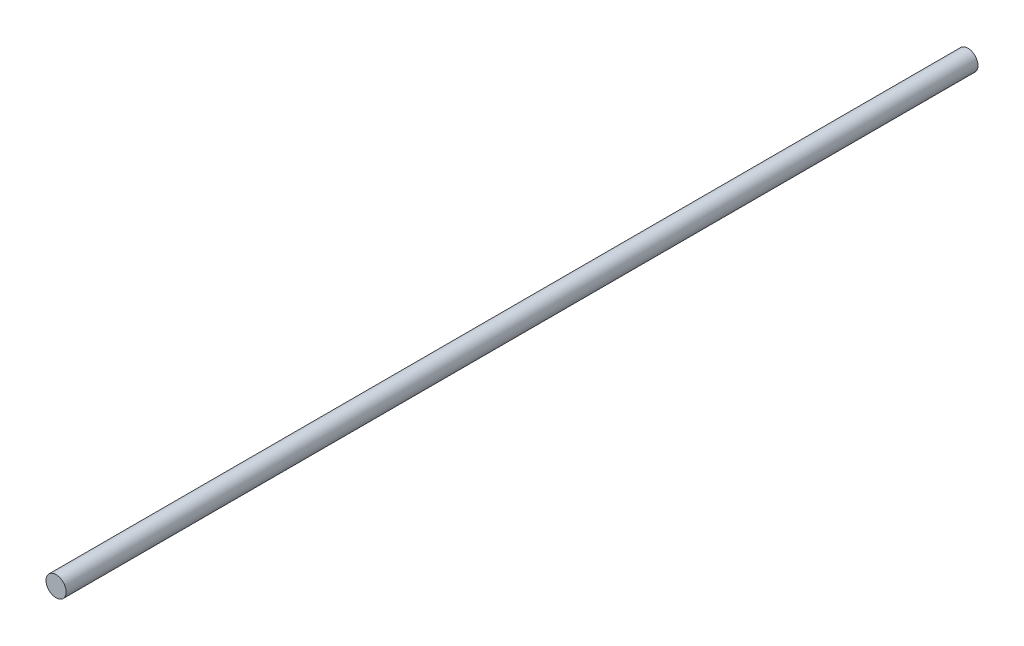
ISO-10303-21;
HEADER;
FILE_DESCRIPTION(('STEP AP214'),'2;1');
FILE_NAME('part.step','',(''),(''),'','','');
FILE_SCHEMA(('AUTOMOTIVE_DESIGN { 1 0 10303 214 1 1 1 1 }'));
ENDSEC;
DATA;
#1=APPLICATION_CONTEXT('core data for automotive mechanical design processes');
#2=APPLICATION_PROTOCOL_DEFINITION('international standard','automotive_design',2000,#1);
#3=PRODUCT_CONTEXT('',#1,'mechanical');
#4=PRODUCT('Part','Part','',(#3));
#5=PRODUCT_RELATED_PRODUCT_CATEGORY('part','',(#4));
#6=PRODUCT_DEFINITION_FORMATION('','',#4);
#7=PRODUCT_DEFINITION_CONTEXT('part definition',#1,'design');
#8=PRODUCT_DEFINITION('design','',#6,#7);
#9=PRODUCT_DEFINITION_SHAPE('','',#8);
#10=(LENGTH_UNIT() NAMED_UNIT(*) SI_UNIT(.MILLI.,.METRE.));
#11=(NAMED_UNIT(*) PLANE_ANGLE_UNIT() SI_UNIT($,.RADIAN.));
#12=(NAMED_UNIT(*) SI_UNIT($,.STERADIAN.) SOLID_ANGLE_UNIT());
#13=UNCERTAINTY_MEASURE_WITH_UNIT(LENGTH_MEASURE(1.E-05),#10,'distance_accuracy_value','');
#14=(GEOMETRIC_REPRESENTATION_CONTEXT(3) GLOBAL_UNCERTAINTY_ASSIGNED_CONTEXT((#13)) GLOBAL_UNIT_ASSIGNED_CONTEXT((#10,
#11,#12)) REPRESENTATION_CONTEXT('',''));
#15=CARTESIAN_POINT('',(0.,0.,0.));
#16=DIRECTION('',(0.,0.,1.));
#17=DIRECTION('',(1.,0.,0.));
#18=AXIS2_PLACEMENT_3D('',#15,#16,#17);
#19=CARTESIAN_POINT('',(0.,0.,362.));
#20=DIRECTION('',(0.,0.,-1.));
#21=DIRECTION('',(-1.,0.,0.));
#22=AXIS2_PLACEMENT_3D('',#19,#20,#21);
#23=CYLINDRICAL_SURFACE('',#22,4.);
#24=CARTESIAN_POINT('',(0.,0.,362.));
#25=DIRECTION('',(0.,0.,1.));
#26=DIRECTION('',(1.,0.,0.));
#27=AXIS2_PLACEMENT_3D('',#24,#25,#26);
#28=CIRCLE('',#27,4.);
#29=CARTESIAN_POINT('',(4.,0.,362.));
#30=VERTEX_POINT('',#29);
#31=EDGE_CURVE('E10',#30,#30,#28,.T.);
#32=ORIENTED_EDGE('',*,*,#31,.F.);
#33=EDGE_LOOP('',(#32));
#34=FACE_BOUND('',#33,.T.);
#35=CARTESIAN_POINT('',(0.,0.,0.));
#36=DIRECTION('',(0.,0.,1.));
#37=DIRECTION('',(1.,0.,0.));
#38=AXIS2_PLACEMENT_3D('',#35,#36,#37);
#39=CIRCLE('',#38,4.);
#40=CARTESIAN_POINT('',(4.,0.,0.));
#41=VERTEX_POINT('',#40);
#42=EDGE_CURVE('E35',#41,#41,#39,.T.);
#43=ORIENTED_EDGE('',*,*,#42,.T.);
#44=EDGE_LOOP('',(#43));
#45=FACE_BOUND('',#44,.T.);
#46=ADVANCED_FACE('F32',(#34,#45),#23,.T.);
#47=CARTESIAN_POINT('',(0.,0.,362.));
#48=DIRECTION('',(0.,0.,1.));
#49=DIRECTION('',(1.,0.,0.));
#50=AXIS2_PLACEMENT_3D('',#47,#48,#49);
#51=PLANE('',#50);
#52=ORIENTED_EDGE('',*,*,#31,.T.);
#53=EDGE_LOOP('',(#52));
#54=FACE_BOUND('',#53,.T.);
#55=ADVANCED_FACE('F47',(#54),#51,.T.);
#56=CARTESIAN_POINT('',(0.,0.,0.));
#57=DIRECTION('',(0.,0.,1.));
#58=DIRECTION('',(1.,0.,0.));
#59=AXIS2_PLACEMENT_3D('',#56,#57,#58);
#60=PLANE('',#59);
#61=ORIENTED_EDGE('',*,*,#42,.F.);
#62=EDGE_LOOP('',(#61));
#63=FACE_BOUND('',#62,.T.);
#64=ADVANCED_FACE('F45',(#63),#60,.F.);
#65=CLOSED_SHELL('',(#46,#55,#64));
#66=MANIFOLD_SOLID_BREP('B2',#65);
#67=ADVANCED_BREP_SHAPE_REPRESENTATION('',(#18,#66),#14);
#68=SHAPE_DEFINITION_REPRESENTATION(#9,#67);
ENDSEC;
END-ISO-10303-21;
